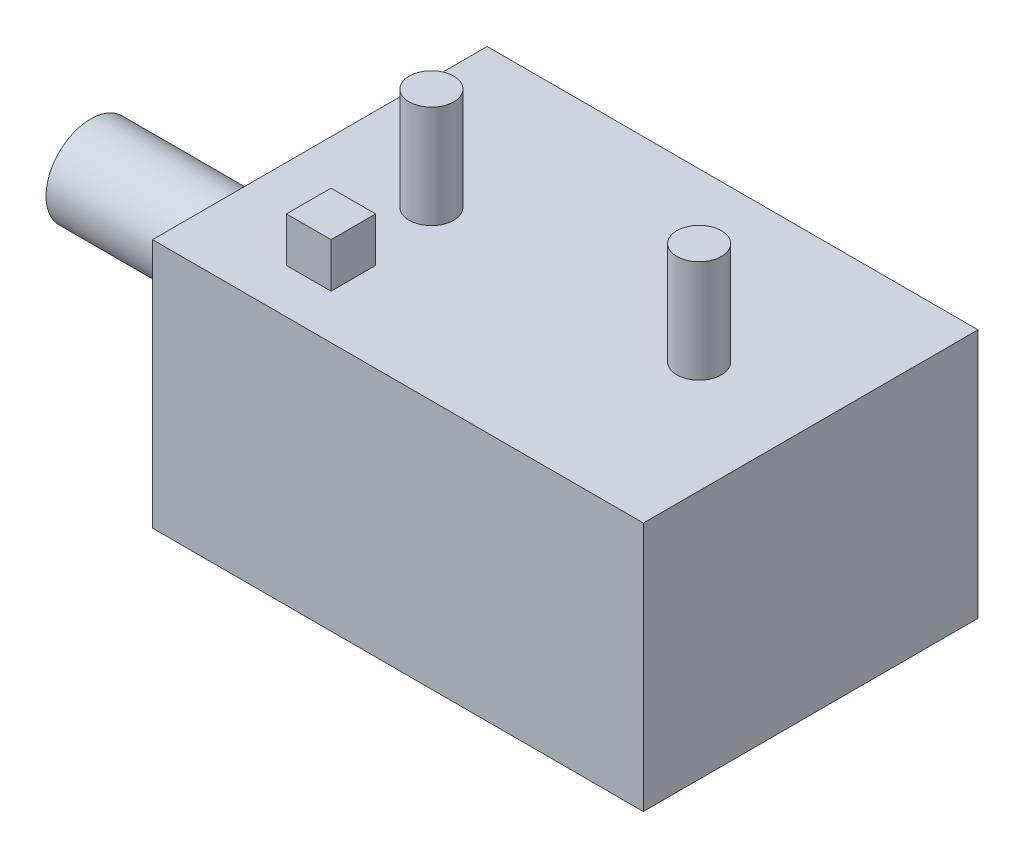
ISO-10303-21;
HEADER;
FILE_DESCRIPTION(('STEP AP214'),'2;1');
FILE_NAME('part.step','',(''),(''),'','','');
FILE_SCHEMA(('AUTOMOTIVE_DESIGN { 1 0 10303 214 1 1 1 1 }'));
ENDSEC;
DATA;
#1=APPLICATION_CONTEXT('core data for automotive mechanical design processes');
#2=APPLICATION_PROTOCOL_DEFINITION('international standard','automotive_design',2000,#1);
#3=PRODUCT_CONTEXT('',#1,'mechanical');
#4=PRODUCT('Part','Part','',(#3));
#5=PRODUCT_RELATED_PRODUCT_CATEGORY('part','',(#4));
#6=PRODUCT_DEFINITION_FORMATION('','',#4);
#7=PRODUCT_DEFINITION_CONTEXT('part definition',#1,'design');
#8=PRODUCT_DEFINITION('design','',#6,#7);
#9=PRODUCT_DEFINITION_SHAPE('','',#8);
#10=(LENGTH_UNIT() NAMED_UNIT(*) SI_UNIT(.MILLI.,.METRE.));
#11=(NAMED_UNIT(*) PLANE_ANGLE_UNIT() SI_UNIT($,.RADIAN.));
#12=(NAMED_UNIT(*) SI_UNIT($,.STERADIAN.) SOLID_ANGLE_UNIT());
#13=UNCERTAINTY_MEASURE_WITH_UNIT(LENGTH_MEASURE(1.E-05),#10,'distance_accuracy_value','');
#14=(GEOMETRIC_REPRESENTATION_CONTEXT(3) GLOBAL_UNCERTAINTY_ASSIGNED_CONTEXT((#13)) GLOBAL_UNIT_ASSIGNED_CONTEXT((#10,
#11,#12)) REPRESENTATION_CONTEXT('',''));
#15=CARTESIAN_POINT('',(0.,0.,0.));
#16=DIRECTION('',(0.,0.,1.));
#17=DIRECTION('',(1.,0.,0.));
#18=AXIS2_PLACEMENT_3D('',#15,#16,#17);
#19=CARTESIAN_POINT('',(0.,56.,0.));
#20=DIRECTION('',(0.,1.,0.));
#21=DIRECTION('',(0.,0.,1.));
#22=AXIS2_PLACEMENT_3D('',#19,#20,#21);
#23=PLANE('',#22);
#24=CARTESIAN_POINT('',(-30.,56.,0.));
#25=DIRECTION('',(0.,1.,0.));
#26=DIRECTION('',(0.,0.,1.));
#27=AXIS2_PLACEMENT_3D('',#24,#25,#26);
#28=CIRCLE('',#27,5.);
#29=CARTESIAN_POINT('',(-30.,56.,5.));
#30=VERTEX_POINT('',#29);
#31=EDGE_CURVE('E136',#30,#30,#28,.T.);
#32=ORIENTED_EDGE('',*,*,#31,.F.);
#33=EDGE_LOOP('',(#32));
#34=FACE_BOUND('',#33,.T.);
#35=CARTESIAN_POINT('',(30.,56.,0.));
#36=DIRECTION('',(0.,1.,0.));
#37=DIRECTION('',(0.,0.,1.));
#38=AXIS2_PLACEMENT_3D('',#35,#36,#37);
#39=CIRCLE('',#38,5.);
#40=CARTESIAN_POINT('',(30.,56.,5.));
#41=VERTEX_POINT('',#40);
#42=EDGE_CURVE('E144',#41,#41,#39,.T.);
#43=ORIENTED_EDGE('',*,*,#42,.F.);
#44=EDGE_LOOP('',(#43));
#45=FACE_BOUND('',#44,.T.);
#46=DIRECTION('',(0.,0.,-1.));
#47=VECTOR('',#46,1.);
#48=CARTESIAN_POINT('',(55.,56.,-37.5));
#49=LINE('',#48,#47);
#50=CARTESIAN_POINT('',(55.,56.,37.5));
#51=VERTEX_POINT('',#50);
#52=CARTESIAN_POINT('',(55.,56.,-37.5));
#53=VERTEX_POINT('',#52);
#54=EDGE_CURVE('E153',#51,#53,#49,.T.);
#55=ORIENTED_EDGE('',*,*,#54,.T.);
#56=DIRECTION('',(-1.,0.,0.));
#57=VECTOR('',#56,1.);
#58=CARTESIAN_POINT('',(-55.,56.,-37.5));
#59=LINE('',#58,#57);
#60=CARTESIAN_POINT('',(-55.,56.,-37.5));
#61=VERTEX_POINT('',#60);
#62=EDGE_CURVE('E86',#53,#61,#59,.T.);
#63=ORIENTED_EDGE('',*,*,#62,.T.);
#64=DIRECTION('',(0.,0.,1.));
#65=VECTOR('',#64,1.);
#66=CARTESIAN_POINT('',(-55.,56.,-37.5));
#67=LINE('',#66,#65);
#68=CARTESIAN_POINT('',(-55.,56.,37.5));
#69=VERTEX_POINT('',#68);
#70=EDGE_CURVE('E156',#61,#69,#67,.T.);
#71=ORIENTED_EDGE('',*,*,#70,.T.);
#72=DIRECTION('',(1.,0.,0.));
#73=VECTOR('',#72,1.);
#74=CARTESIAN_POINT('',(-55.,56.,37.5));
#75=LINE('',#74,#73);
#76=EDGE_CURVE('E57',#69,#51,#75,.T.);
#77=ORIENTED_EDGE('',*,*,#76,.T.);
#78=EDGE_LOOP('',(#55,#63,#71,#77));
#79=FACE_BOUND('',#78,.T.);
#80=DIRECTION('',(-1.,0.,0.));
#81=VECTOR('',#80,1.);
#82=CARTESIAN_POINT('',(-35.,56.,17.5));
#83=LINE('',#82,#81);
#84=CARTESIAN_POINT('',(-25.,56.,17.5));
#85=VERTEX_POINT('',#84);
#86=CARTESIAN_POINT('',(-35.,56.,17.5));
#87=VERTEX_POINT('',#86);
#88=EDGE_CURVE('E190',#85,#87,#83,.T.);
#89=ORIENTED_EDGE('',*,*,#88,.F.);
#90=DIRECTION('',(0.,0.,-1.));
#91=VECTOR('',#90,1.);
#92=CARTESIAN_POINT('',(-25.,56.,17.5));
#93=LINE('',#92,#91);
#94=CARTESIAN_POINT('',(-25.,56.,27.5));
#95=VERTEX_POINT('',#94);
#96=EDGE_CURVE('E131',#95,#85,#93,.T.);
#97=ORIENTED_EDGE('',*,*,#96,.F.);
#98=DIRECTION('',(1.,0.,0.));
#99=VECTOR('',#98,1.);
#100=CARTESIAN_POINT('',(-35.,56.,27.5));
#101=LINE('',#100,#99);
#102=CARTESIAN_POINT('',(-35.,56.,27.5));
#103=VERTEX_POINT('',#102);
#104=EDGE_CURVE('E127',#103,#95,#101,.T.);
#105=ORIENTED_EDGE('',*,*,#104,.F.);
#106=DIRECTION('',(0.,0.,1.));
#107=VECTOR('',#106,1.);
#108=CARTESIAN_POINT('',(-35.,56.,17.5));
#109=LINE('',#108,#107);
#110=EDGE_CURVE('E192',#87,#103,#109,.T.);
#111=ORIENTED_EDGE('',*,*,#110,.F.);
#112=EDGE_LOOP('',(#89,#97,#105,#111));
#113=FACE_BOUND('',#112,.T.);
#114=ADVANCED_FACE('F33',(#34,#45,#79,#113),#23,.T.);
#115=CARTESIAN_POINT('',(55.,56.,-37.5));
#116=DIRECTION('',(-1.,0.,0.));
#117=DIRECTION('',(0.,0.,1.));
#118=AXIS2_PLACEMENT_3D('',#115,#116,#117);
#119=PLANE('',#118);
#120=DIRECTION('',(0.,0.,-1.));
#121=VECTOR('',#120,1.);
#122=CARTESIAN_POINT('',(55.,0.,-37.5));
#123=LINE('',#122,#121);
#124=CARTESIAN_POINT('',(55.,0.,37.5));
#125=VERTEX_POINT('',#124);
#126=CARTESIAN_POINT('',(55.,0.,-37.5));
#127=VERTEX_POINT('',#126);
#128=EDGE_CURVE('E150',#125,#127,#123,.T.);
#129=ORIENTED_EDGE('',*,*,#128,.T.);
#130=DIRECTION('',(0.,-1.,0.));
#131=VECTOR('',#130,1.);
#132=CARTESIAN_POINT('',(55.,56.,-37.5));
#133=LINE('',#132,#131);
#134=EDGE_CURVE('E41',#53,#127,#133,.T.);
#135=ORIENTED_EDGE('',*,*,#134,.F.);
#136=ORIENTED_EDGE('',*,*,#54,.F.);
#137=DIRECTION('',(0.,-1.,0.));
#138=VECTOR('',#137,1.);
#139=CARTESIAN_POINT('',(55.,56.,37.5));
#140=LINE('',#139,#138);
#141=EDGE_CURVE('E159',#51,#125,#140,.T.);
#142=ORIENTED_EDGE('',*,*,#141,.T.);
#143=EDGE_LOOP('',(#129,#135,#136,#142));
#144=FACE_BOUND('',#143,.T.);
#145=ADVANCED_FACE('F35',(#144),#119,.F.);
#146=CARTESIAN_POINT('',(-55.,56.,-37.5));
#147=DIRECTION('',(0.,0.,1.));
#148=DIRECTION('',(1.,0.,0.));
#149=AXIS2_PLACEMENT_3D('',#146,#147,#148);
#150=PLANE('',#149);
#151=DIRECTION('',(-1.,0.,0.));
#152=VECTOR('',#151,1.);
#153=CARTESIAN_POINT('',(-55.,0.,-37.5));
#154=LINE('',#153,#152);
#155=CARTESIAN_POINT('',(-55.,0.,-37.5));
#156=VERTEX_POINT('',#155);
#157=EDGE_CURVE('E162',#127,#156,#154,.T.);
#158=ORIENTED_EDGE('',*,*,#157,.T.);
#159=DIRECTION('',(0.,-1.,0.));
#160=VECTOR('',#159,1.);
#161=CARTESIAN_POINT('',(-55.,56.,-37.5));
#162=LINE('',#161,#160);
#163=EDGE_CURVE('E170',#61,#156,#162,.T.);
#164=ORIENTED_EDGE('',*,*,#163,.F.);
#165=ORIENTED_EDGE('',*,*,#62,.F.);
#166=ORIENTED_EDGE('',*,*,#134,.T.);
#167=EDGE_LOOP('',(#158,#164,#165,#166));
#168=FACE_BOUND('',#167,.T.);
#169=ADVANCED_FACE('F173',(#168),#150,.F.);
#170=CARTESIAN_POINT('',(-55.,56.,-37.5));
#171=DIRECTION('',(1.,0.,0.));
#172=DIRECTION('',(0.,0.,-1.));
#173=AXIS2_PLACEMENT_3D('',#170,#171,#172);
#174=PLANE('',#173);
#175=CARTESIAN_POINT('',(-55.,25.,0.));
#176=DIRECTION('',(1.,0.,0.));
#177=DIRECTION('',(0.,0.,-1.));
#178=AXIS2_PLACEMENT_3D('',#175,#176,#177);
#179=CIRCLE('',#178,10.);
#180=CARTESIAN_POINT('',(-55.,25.,-10.));
#181=VERTEX_POINT('',#180);
#182=EDGE_CURVE('E11',#181,#181,#179,.F.);
#183=ORIENTED_EDGE('',*,*,#182,.F.);
#184=EDGE_LOOP('',(#183));
#185=FACE_BOUND('',#184,.T.);
#186=DIRECTION('',(0.,0.,1.));
#187=VECTOR('',#186,1.);
#188=CARTESIAN_POINT('',(-55.,0.,-37.5));
#189=LINE('',#188,#187);
#190=CARTESIAN_POINT('',(-55.,0.,37.5));
#191=VERTEX_POINT('',#190);
#192=EDGE_CURVE('E164',#156,#191,#189,.T.);
#193=ORIENTED_EDGE('',*,*,#192,.T.);
#194=DIRECTION('',(0.,-1.,0.));
#195=VECTOR('',#194,1.);
#196=CARTESIAN_POINT('',(-55.,56.,37.5));
#197=LINE('',#196,#195);
#198=EDGE_CURVE('E168',#69,#191,#197,.T.);
#199=ORIENTED_EDGE('',*,*,#198,.F.);
#200=ORIENTED_EDGE('',*,*,#70,.F.);
#201=ORIENTED_EDGE('',*,*,#163,.T.);
#202=EDGE_LOOP('',(#193,#199,#200,#201));
#203=FACE_BOUND('',#202,.T.);
#204=ADVANCED_FACE('F182',(#185,#203),#174,.F.);
#205=CARTESIAN_POINT('',(-55.,56.,37.5));
#206=DIRECTION('',(0.,0.,-1.));
#207=DIRECTION('',(-1.,0.,0.));
#208=AXIS2_PLACEMENT_3D('',#205,#206,#207);
#209=PLANE('',#208);
#210=DIRECTION('',(1.,0.,0.));
#211=VECTOR('',#210,1.);
#212=CARTESIAN_POINT('',(-55.,0.,37.5));
#213=LINE('',#212,#211);
#214=EDGE_CURVE('E78',#191,#125,#213,.T.);
#215=ORIENTED_EDGE('',*,*,#214,.T.);
#216=ORIENTED_EDGE('',*,*,#141,.F.);
#217=ORIENTED_EDGE('',*,*,#76,.F.);
#218=ORIENTED_EDGE('',*,*,#198,.T.);
#219=EDGE_LOOP('',(#215,#216,#217,#218));
#220=FACE_BOUND('',#219,.T.);
#221=ADVANCED_FACE('F184',(#220),#209,.F.);
#222=CARTESIAN_POINT('',(0.,0.,0.));
#223=DIRECTION('',(0.,1.,0.));
#224=DIRECTION('',(0.,0.,1.));
#225=AXIS2_PLACEMENT_3D('',#222,#223,#224);
#226=PLANE('',#225);
#227=ORIENTED_EDGE('',*,*,#128,.F.);
#228=ORIENTED_EDGE('',*,*,#214,.F.);
#229=ORIENTED_EDGE('',*,*,#192,.F.);
#230=ORIENTED_EDGE('',*,*,#157,.F.);
#231=EDGE_LOOP('',(#227,#228,#229,#230));
#232=FACE_BOUND('',#231,.T.);
#233=ADVANCED_FACE('F178',(#232),#226,.F.);
#234=CARTESIAN_POINT('',(30.,79.,0.));
#235=DIRECTION('',(0.,-1.,0.));
#236=DIRECTION('',(0.,0.,-1.));
#237=AXIS2_PLACEMENT_3D('',#234,#235,#236);
#238=CYLINDRICAL_SURFACE('',#237,5.);
#239=CARTESIAN_POINT('',(30.,79.,0.));
#240=DIRECTION('',(0.,1.,0.));
#241=DIRECTION('',(0.,0.,1.));
#242=AXIS2_PLACEMENT_3D('',#239,#240,#241);
#243=CIRCLE('',#242,5.);
#244=CARTESIAN_POINT('',(30.,79.,5.));
#245=VERTEX_POINT('',#244);
#246=EDGE_CURVE('E147',#245,#245,#243,.T.);
#247=ORIENTED_EDGE('',*,*,#246,.F.);
#248=EDGE_LOOP('',(#247));
#249=FACE_BOUND('',#248,.T.);
#250=ORIENTED_EDGE('',*,*,#42,.T.);
#251=EDGE_LOOP('',(#250));
#252=FACE_BOUND('',#251,.T.);
#253=ADVANCED_FACE('F236',(#249,#252),#238,.T.);
#254=CARTESIAN_POINT('',(30.,79.,0.));
#255=DIRECTION('',(0.,1.,0.));
#256=DIRECTION('',(0.,0.,1.));
#257=AXIS2_PLACEMENT_3D('',#254,#255,#256);
#258=PLANE('',#257);
#259=ORIENTED_EDGE('',*,*,#246,.T.);
#260=EDGE_LOOP('',(#259));
#261=FACE_BOUND('',#260,.T.);
#262=ADVANCED_FACE('F232',(#261),#258,.T.);
#263=CARTESIAN_POINT('',(-30.,79.,0.));
#264=DIRECTION('',(0.,-1.,0.));
#265=DIRECTION('',(0.,0.,-1.));
#266=AXIS2_PLACEMENT_3D('',#263,#264,#265);
#267=CYLINDRICAL_SURFACE('',#266,5.);
#268=CARTESIAN_POINT('',(-30.,79.,0.));
#269=DIRECTION('',(0.,1.,0.));
#270=DIRECTION('',(0.,0.,1.));
#271=AXIS2_PLACEMENT_3D('',#268,#269,#270);
#272=CIRCLE('',#271,5.);
#273=CARTESIAN_POINT('',(-30.,79.,5.));
#274=VERTEX_POINT('',#273);
#275=EDGE_CURVE('E141',#274,#274,#272,.T.);
#276=ORIENTED_EDGE('',*,*,#275,.F.);
#277=EDGE_LOOP('',(#276));
#278=FACE_BOUND('',#277,.T.);
#279=ORIENTED_EDGE('',*,*,#31,.T.);
#280=EDGE_LOOP('',(#279));
#281=FACE_BOUND('',#280,.T.);
#282=ADVANCED_FACE('F228',(#278,#281),#267,.T.);
#283=CARTESIAN_POINT('',(-30.,79.,0.));
#284=DIRECTION('',(0.,1.,0.));
#285=DIRECTION('',(0.,0.,1.));
#286=AXIS2_PLACEMENT_3D('',#283,#284,#285);
#287=PLANE('',#286);
#288=ORIENTED_EDGE('',*,*,#275,.T.);
#289=EDGE_LOOP('',(#288));
#290=FACE_BOUND('',#289,.T.);
#291=ADVANCED_FACE('F224',(#290),#287,.T.);
#292=CARTESIAN_POINT('',(-106.38,25.,0.));
#293=DIRECTION('',(1.,0.,0.));
#294=DIRECTION('',(0.,0.,-1.));
#295=AXIS2_PLACEMENT_3D('',#292,#293,#294);
#296=CYLINDRICAL_SURFACE('',#295,10.);
#297=CARTESIAN_POINT('',(-106.38,25.,0.));
#298=DIRECTION('',(-1.,0.,0.));
#299=DIRECTION('',(0.,0.,1.));
#300=AXIS2_PLACEMENT_3D('',#297,#298,#299);
#301=CIRCLE('',#300,10.);
#302=CARTESIAN_POINT('',(-106.38,25.,10.));
#303=VERTEX_POINT('',#302);
#304=EDGE_CURVE('E133',#303,#303,#301,.T.);
#305=ORIENTED_EDGE('',*,*,#304,.F.);
#306=EDGE_LOOP('',(#305));
#307=FACE_BOUND('',#306,.T.);
#308=ORIENTED_EDGE('',*,*,#182,.T.);
#309=EDGE_LOOP('',(#308));
#310=FACE_BOUND('',#309,.T.);
#311=ADVANCED_FACE('F220',(#307,#310),#296,.T.);
#312=CARTESIAN_POINT('',(-106.38,25.,0.));
#313=DIRECTION('',(-1.,0.,0.));
#314=DIRECTION('',(0.,0.,1.));
#315=AXIS2_PLACEMENT_3D('',#312,#313,#314);
#316=PLANE('',#315);
#317=ORIENTED_EDGE('',*,*,#304,.T.);
#318=EDGE_LOOP('',(#317));
#319=FACE_BOUND('',#318,.T.);
#320=ADVANCED_FACE('F217',(#319),#316,.T.);
#321=CARTESIAN_POINT('',(-25.,66.,17.5));
#322=DIRECTION('',(-1.,0.,0.));
#323=DIRECTION('',(0.,0.,1.));
#324=AXIS2_PLACEMENT_3D('',#321,#322,#323);
#325=PLANE('',#324);
#326=ORIENTED_EDGE('',*,*,#96,.T.);
#327=DIRECTION('',(0.,-1.,0.));
#328=VECTOR('',#327,1.);
#329=CARTESIAN_POINT('',(-25.,66.,17.5));
#330=LINE('',#329,#328);
#331=CARTESIAN_POINT('',(-25.,66.,17.5));
#332=VERTEX_POINT('',#331);
#333=EDGE_CURVE('E112',#332,#85,#330,.T.);
#334=ORIENTED_EDGE('',*,*,#333,.F.);
#335=DIRECTION('',(0.,0.,-1.));
#336=VECTOR('',#335,1.);
#337=CARTESIAN_POINT('',(-25.,66.,17.5));
#338=LINE('',#337,#336);
#339=CARTESIAN_POINT('',(-25.,66.,27.5));
#340=VERTEX_POINT('',#339);
#341=EDGE_CURVE('E119',#340,#332,#338,.T.);
#342=ORIENTED_EDGE('',*,*,#341,.F.);
#343=DIRECTION('',(0.,-1.,0.));
#344=VECTOR('',#343,1.);
#345=CARTESIAN_POINT('',(-25.,66.,27.5));
#346=LINE('',#345,#344);
#347=EDGE_CURVE('E199',#340,#95,#346,.T.);
#348=ORIENTED_EDGE('',*,*,#347,.T.);
#349=EDGE_LOOP('',(#326,#334,#342,#348));
#350=FACE_BOUND('',#349,.T.);
#351=ADVANCED_FACE('F129',(#350),#325,.F.);
#352=CARTESIAN_POINT('',(-35.,66.,17.5));
#353=DIRECTION('',(0.,0.,1.));
#354=DIRECTION('',(1.,0.,0.));
#355=AXIS2_PLACEMENT_3D('',#352,#353,#354);
#356=PLANE('',#355);
#357=ORIENTED_EDGE('',*,*,#88,.T.);
#358=DIRECTION('',(0.,-1.,0.));
#359=VECTOR('',#358,1.);
#360=CARTESIAN_POINT('',(-35.,66.,17.5));
#361=LINE('',#360,#359);
#362=CARTESIAN_POINT('',(-35.,66.,17.5));
#363=VERTEX_POINT('',#362);
#364=EDGE_CURVE('E115',#363,#87,#361,.T.);
#365=ORIENTED_EDGE('',*,*,#364,.F.);
#366=DIRECTION('',(-1.,0.,0.));
#367=VECTOR('',#366,1.);
#368=CARTESIAN_POINT('',(-35.,66.,17.5));
#369=LINE('',#368,#367);
#370=EDGE_CURVE('E108',#332,#363,#369,.T.);
#371=ORIENTED_EDGE('',*,*,#370,.F.);
#372=ORIENTED_EDGE('',*,*,#333,.T.);
#373=EDGE_LOOP('',(#357,#365,#371,#372));
#374=FACE_BOUND('',#373,.T.);
#375=ADVANCED_FACE('F110',(#374),#356,.F.);
#376=CARTESIAN_POINT('',(-35.,66.,17.5));
#377=DIRECTION('',(1.,0.,0.));
#378=DIRECTION('',(0.,0.,-1.));
#379=AXIS2_PLACEMENT_3D('',#376,#377,#378);
#380=PLANE('',#379);
#381=ORIENTED_EDGE('',*,*,#110,.T.);
#382=DIRECTION('',(0.,-1.,0.));
#383=VECTOR('',#382,1.);
#384=CARTESIAN_POINT('',(-35.,66.,27.5));
#385=LINE('',#384,#383);
#386=CARTESIAN_POINT('',(-35.,66.,27.5));
#387=VERTEX_POINT('',#386);
#388=EDGE_CURVE('E48',#387,#103,#385,.T.);
#389=ORIENTED_EDGE('',*,*,#388,.F.);
#390=DIRECTION('',(0.,0.,1.));
#391=VECTOR('',#390,1.);
#392=CARTESIAN_POINT('',(-35.,66.,17.5));
#393=LINE('',#392,#391);
#394=EDGE_CURVE('E118',#363,#387,#393,.T.);
#395=ORIENTED_EDGE('',*,*,#394,.F.);
#396=ORIENTED_EDGE('',*,*,#364,.T.);
#397=EDGE_LOOP('',(#381,#389,#395,#396));
#398=FACE_BOUND('',#397,.T.);
#399=ADVANCED_FACE('F202',(#398),#380,.F.);
#400=CARTESIAN_POINT('',(-35.,66.,27.5));
#401=DIRECTION('',(0.,0.,-1.));
#402=DIRECTION('',(-1.,0.,0.));
#403=AXIS2_PLACEMENT_3D('',#400,#401,#402);
#404=PLANE('',#403);
#405=ORIENTED_EDGE('',*,*,#104,.T.);
#406=ORIENTED_EDGE('',*,*,#347,.F.);
#407=DIRECTION('',(1.,0.,0.));
#408=VECTOR('',#407,1.);
#409=CARTESIAN_POINT('',(-35.,66.,27.5));
#410=LINE('',#409,#408);
#411=EDGE_CURVE('E123',#387,#340,#410,.T.);
#412=ORIENTED_EDGE('',*,*,#411,.F.);
#413=ORIENTED_EDGE('',*,*,#388,.T.);
#414=EDGE_LOOP('',(#405,#406,#412,#413));
#415=FACE_BOUND('',#414,.T.);
#416=ADVANCED_FACE('F203',(#415),#404,.F.);
#417=CARTESIAN_POINT('',(0.,66.,0.));
#418=DIRECTION('',(0.,1.,0.));
#419=DIRECTION('',(0.,0.,1.));
#420=AXIS2_PLACEMENT_3D('',#417,#418,#419);
#421=PLANE('',#420);
#422=ORIENTED_EDGE('',*,*,#341,.T.);
#423=ORIENTED_EDGE('',*,*,#370,.T.);
#424=ORIENTED_EDGE('',*,*,#394,.T.);
#425=ORIENTED_EDGE('',*,*,#411,.T.);
#426=EDGE_LOOP('',(#422,#423,#424,#425));
#427=FACE_BOUND('',#426,.T.);
#428=ADVANCED_FACE('F122',(#427),#421,.T.);
#429=CLOSED_SHELL('',(#114,#145,#169,#204,#221,#233,#253,#262,#282,#291,#311,#320,#351,#375,
#399,#416,#428));
#430=MANIFOLD_SOLID_BREP('B2',#429);
#431=ADVANCED_BREP_SHAPE_REPRESENTATION('',(#18,#430),#14);
#432=SHAPE_DEFINITION_REPRESENTATION(#9,#431);
ENDSEC;
END-ISO-10303-21;
